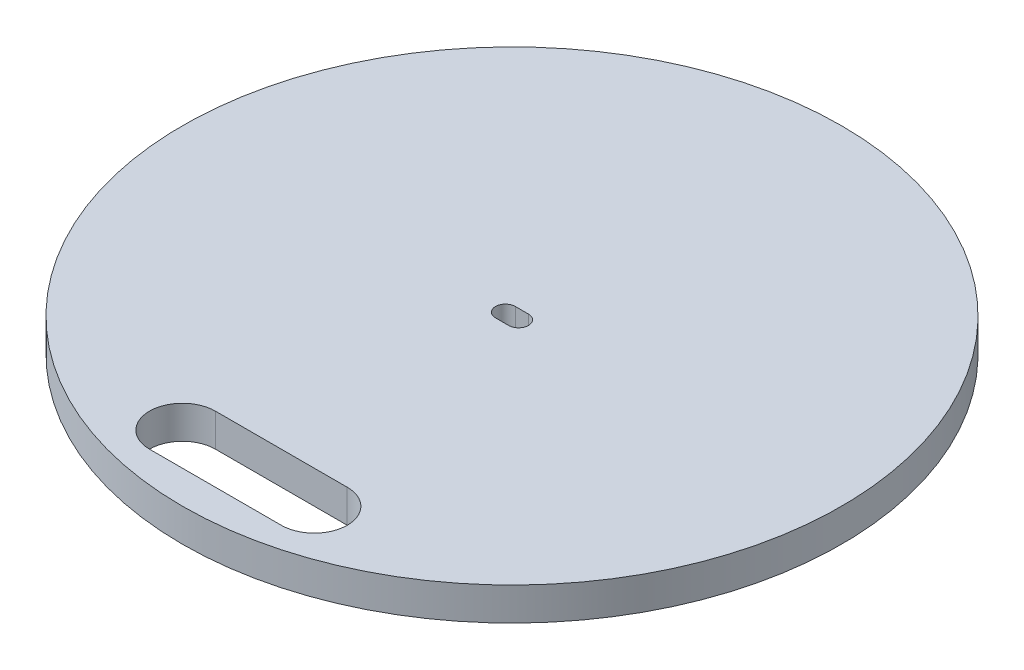
ISO-10303-21;
HEADER;
FILE_DESCRIPTION(('STEP AP214'),'2;1');
FILE_NAME('part.step','',(''),(''),'','','');
FILE_SCHEMA(('AUTOMOTIVE_DESIGN { 1 0 10303 214 1 1 1 1 }'));
ENDSEC;
DATA;
#1=APPLICATION_CONTEXT('core data for automotive mechanical design processes');
#2=APPLICATION_PROTOCOL_DEFINITION('international standard','automotive_design',2000,#1);
#3=PRODUCT_CONTEXT('',#1,'mechanical');
#4=PRODUCT('Part','Part','',(#3));
#5=PRODUCT_RELATED_PRODUCT_CATEGORY('part','',(#4));
#6=PRODUCT_DEFINITION_FORMATION('','',#4);
#7=PRODUCT_DEFINITION_CONTEXT('part definition',#1,'design');
#8=PRODUCT_DEFINITION('design','',#6,#7);
#9=PRODUCT_DEFINITION_SHAPE('','',#8);
#10=(LENGTH_UNIT() NAMED_UNIT(*) SI_UNIT(.MILLI.,.METRE.));
#11=(NAMED_UNIT(*) PLANE_ANGLE_UNIT() SI_UNIT($,.RADIAN.));
#12=(NAMED_UNIT(*) SI_UNIT($,.STERADIAN.) SOLID_ANGLE_UNIT());
#13=UNCERTAINTY_MEASURE_WITH_UNIT(LENGTH_MEASURE(1.E-05),#10,'distance_accuracy_value','');
#14=(GEOMETRIC_REPRESENTATION_CONTEXT(3) GLOBAL_UNCERTAINTY_ASSIGNED_CONTEXT((#13)) GLOBAL_UNIT_ASSIGNED_CONTEXT((#10,
#11,#12)) REPRESENTATION_CONTEXT('',''));
#15=CARTESIAN_POINT('',(0.,0.,0.));
#16=DIRECTION('',(0.,0.,1.));
#17=DIRECTION('',(1.,0.,0.));
#18=AXIS2_PLACEMENT_3D('',#15,#16,#17);
#19=CARTESIAN_POINT('',(0.,5.,0.));
#20=DIRECTION('',(0.,-1.,0.));
#21=DIRECTION('',(0.,0.,-1.));
#22=AXIS2_PLACEMENT_3D('',#19,#20,#21);
#23=CYLINDRICAL_SURFACE('',#22,50.);
#24=CARTESIAN_POINT('',(0.,5.,0.));
#25=DIRECTION('',(0.,1.,0.));
#26=DIRECTION('',(0.,0.,1.));
#27=AXIS2_PLACEMENT_3D('',#24,#25,#26);
#28=CIRCLE('',#27,50.);
#29=CARTESIAN_POINT('',(0.,5.,50.));
#30=VERTEX_POINT('',#29);
#31=EDGE_CURVE('E11',#30,#30,#28,.T.);
#32=ORIENTED_EDGE('',*,*,#31,.F.);
#33=EDGE_LOOP('',(#32));
#34=FACE_BOUND('',#33,.T.);
#35=CARTESIAN_POINT('',(0.,0.,0.));
#36=DIRECTION('',(0.,1.,0.));
#37=DIRECTION('',(0.,0.,1.));
#38=AXIS2_PLACEMENT_3D('',#35,#36,#37);
#39=CIRCLE('',#38,50.);
#40=CARTESIAN_POINT('',(0.,0.,50.));
#41=VERTEX_POINT('',#40);
#42=EDGE_CURVE('E36',#41,#41,#39,.T.);
#43=ORIENTED_EDGE('',*,*,#42,.T.);
#44=EDGE_LOOP('',(#43));
#45=FACE_BOUND('',#44,.T.);
#46=ADVANCED_FACE('F33',(#34,#45),#23,.T.);
#47=CARTESIAN_POINT('',(0.,5.,0.));
#48=DIRECTION('',(0.,1.,0.));
#49=DIRECTION('',(0.,0.,1.));
#50=AXIS2_PLACEMENT_3D('',#47,#48,#49);
#51=PLANE('',#50);
#52=CARTESIAN_POINT('',(-9.99999999999999,5.,40.));
#53=DIRECTION('',(0.,1.,0.));
#54=DIRECTION('',(0.,0.,1.));
#55=AXIS2_PLACEMENT_3D('',#52,#53,#54);
#56=CIRCLE('',#55,5.);
#57=CARTESIAN_POINT('',(-9.99999999999999,5.,35.));
#58=VERTEX_POINT('',#57);
#59=CARTESIAN_POINT('',(-9.99999999999999,5.,45.));
#60=VERTEX_POINT('',#59);
#61=EDGE_CURVE('E47',#58,#60,#56,.T.);
#62=ORIENTED_EDGE('',*,*,#61,.F.);
#63=DIRECTION('',(-1.,0.,0.));
#64=VECTOR('',#63,1.);
#65=CARTESIAN_POINT('',(-9.99999999999999,5.,35.));
#66=LINE('',#65,#64);
#67=CARTESIAN_POINT('',(10.,5.,35.));
#68=VERTEX_POINT('',#67);
#69=EDGE_CURVE('E115',#68,#58,#66,.T.);
#70=ORIENTED_EDGE('',*,*,#69,.F.);
#71=CARTESIAN_POINT('',(10.,5.,40.));
#72=DIRECTION('',(0.,1.,0.));
#73=DIRECTION('',(0.,0.,1.));
#74=AXIS2_PLACEMENT_3D('',#71,#72,#73);
#75=CIRCLE('',#74,5.);
#76=CARTESIAN_POINT('',(10.,5.,45.));
#77=VERTEX_POINT('',#76);
#78=EDGE_CURVE('E118',#77,#68,#75,.T.);
#79=ORIENTED_EDGE('',*,*,#78,.F.);
#80=DIRECTION('',(1.,0.,0.));
#81=VECTOR('',#80,1.);
#82=CARTESIAN_POINT('',(-9.99999999999999,5.,45.));
#83=LINE('',#82,#81);
#84=EDGE_CURVE('E124',#60,#77,#83,.T.);
#85=ORIENTED_EDGE('',*,*,#84,.F.);
#86=EDGE_LOOP('',(#62,#70,#79,#85));
#87=FACE_BOUND('',#86,.T.);
#88=CARTESIAN_POINT('',(-0.999999999999989,5.,0.));
#89=DIRECTION('',(0.,1.,0.));
#90=DIRECTION('',(0.,0.,1.));
#91=AXIS2_PLACEMENT_3D('',#88,#89,#90);
#92=CIRCLE('',#91,1.5);
#93=CARTESIAN_POINT('',(-0.999999999999989,5.,-1.5));
#94=VERTEX_POINT('',#93);
#95=CARTESIAN_POINT('',(-0.999999999999989,5.,1.5));
#96=VERTEX_POINT('',#95);
#97=EDGE_CURVE('E130',#94,#96,#92,.T.);
#98=ORIENTED_EDGE('',*,*,#97,.F.);
#99=DIRECTION('',(-1.,0.,0.));
#100=VECTOR('',#99,1.);
#101=CARTESIAN_POINT('',(-0.999999999999989,5.,-1.5));
#102=LINE('',#101,#100);
#103=CARTESIAN_POINT('',(0.999999999999989,5.,-1.5));
#104=VERTEX_POINT('',#103);
#105=EDGE_CURVE('E138',#104,#94,#102,.T.);
#106=ORIENTED_EDGE('',*,*,#105,.F.);
#107=CARTESIAN_POINT('',(0.999999999999992,5.,0.));
#108=DIRECTION('',(0.,1.,0.));
#109=DIRECTION('',(0.,0.,1.));
#110=AXIS2_PLACEMENT_3D('',#107,#108,#109);
#111=CIRCLE('',#110,1.5);
#112=CARTESIAN_POINT('',(0.999999999999988,5.,1.5));
#113=VERTEX_POINT('',#112);
#114=EDGE_CURVE('E152',#113,#104,#111,.T.);
#115=ORIENTED_EDGE('',*,*,#114,.F.);
#116=DIRECTION('',(1.,0.,0.));
#117=VECTOR('',#116,1.);
#118=CARTESIAN_POINT('',(-0.999999999999989,5.,1.5));
#119=LINE('',#118,#117);
#120=EDGE_CURVE('E149',#96,#113,#119,.T.);
#121=ORIENTED_EDGE('',*,*,#120,.F.);
#122=EDGE_LOOP('',(#98,#106,#115,#121));
#123=FACE_BOUND('',#122,.T.);
#124=ORIENTED_EDGE('',*,*,#31,.T.);
#125=EDGE_LOOP('',(#124));
#126=FACE_BOUND('',#125,.T.);
#127=ADVANCED_FACE('F174',(#87,#123,#126),#51,.T.);
#128=CARTESIAN_POINT('',(0.,0.,0.));
#129=DIRECTION('',(0.,1.,0.));
#130=DIRECTION('',(0.,0.,1.));
#131=AXIS2_PLACEMENT_3D('',#128,#129,#130);
#132=PLANE('',#131);
#133=DIRECTION('',(-1.,0.,0.));
#134=VECTOR('',#133,1.);
#135=CARTESIAN_POINT('',(-9.99999999999999,0.,35.));
#136=LINE('',#135,#134);
#137=CARTESIAN_POINT('',(10.,0.,35.));
#138=VERTEX_POINT('',#137);
#139=CARTESIAN_POINT('',(-9.99999999999999,0.,35.));
#140=VERTEX_POINT('',#139);
#141=EDGE_CURVE('E105',#138,#140,#136,.T.);
#142=ORIENTED_EDGE('',*,*,#141,.T.);
#143=CARTESIAN_POINT('',(-9.99999999999999,0.,40.));
#144=DIRECTION('',(0.,1.,0.));
#145=DIRECTION('',(0.,0.,1.));
#146=AXIS2_PLACEMENT_3D('',#143,#144,#145);
#147=CIRCLE('',#146,5.);
#148=CARTESIAN_POINT('',(-9.99999999999999,0.,45.));
#149=VERTEX_POINT('',#148);
#150=EDGE_CURVE('E99',#140,#149,#147,.T.);
#151=ORIENTED_EDGE('',*,*,#150,.T.);
#152=DIRECTION('',(1.,0.,0.));
#153=VECTOR('',#152,1.);
#154=CARTESIAN_POINT('',(-9.99999999999999,0.,45.));
#155=LINE('',#154,#153);
#156=CARTESIAN_POINT('',(10.,0.,45.));
#157=VERTEX_POINT('',#156);
#158=EDGE_CURVE('E108',#149,#157,#155,.T.);
#159=ORIENTED_EDGE('',*,*,#158,.T.);
#160=CARTESIAN_POINT('',(10.,0.,40.));
#161=DIRECTION('',(0.,1.,0.));
#162=DIRECTION('',(0.,0.,1.));
#163=AXIS2_PLACEMENT_3D('',#160,#161,#162);
#164=CIRCLE('',#163,5.);
#165=EDGE_CURVE('E55',#157,#138,#164,.T.);
#166=ORIENTED_EDGE('',*,*,#165,.T.);
#167=EDGE_LOOP('',(#142,#151,#159,#166));
#168=FACE_BOUND('',#167,.T.);
#169=DIRECTION('',(-1.,0.,0.));
#170=VECTOR('',#169,1.);
#171=CARTESIAN_POINT('',(-0.999999999999989,0.,-1.5));
#172=LINE('',#171,#170);
#173=CARTESIAN_POINT('',(0.999999999999989,0.,-1.5));
#174=VERTEX_POINT('',#173);
#175=CARTESIAN_POINT('',(-0.999999999999989,0.,-1.5));
#176=VERTEX_POINT('',#175);
#177=EDGE_CURVE('E144',#174,#176,#172,.T.);
#178=ORIENTED_EDGE('',*,*,#177,.T.);
#179=CARTESIAN_POINT('',(-0.999999999999989,0.,0.));
#180=DIRECTION('',(0.,1.,0.));
#181=DIRECTION('',(0.,0.,1.));
#182=AXIS2_PLACEMENT_3D('',#179,#180,#181);
#183=CIRCLE('',#182,1.5);
#184=CARTESIAN_POINT('',(-0.999999999999989,0.,1.5));
#185=VERTEX_POINT('',#184);
#186=EDGE_CURVE('E134',#176,#185,#183,.T.);
#187=ORIENTED_EDGE('',*,*,#186,.T.);
#188=DIRECTION('',(1.,0.,0.));
#189=VECTOR('',#188,1.);
#190=CARTESIAN_POINT('',(-0.999999999999989,0.,1.5));
#191=LINE('',#190,#189);
#192=CARTESIAN_POINT('',(0.999999999999988,0.,1.5));
#193=VERTEX_POINT('',#192);
#194=EDGE_CURVE('E137',#185,#193,#191,.T.);
#195=ORIENTED_EDGE('',*,*,#194,.T.);
#196=CARTESIAN_POINT('',(0.999999999999992,0.,0.));
#197=DIRECTION('',(0.,1.,0.));
#198=DIRECTION('',(0.,0.,1.));
#199=AXIS2_PLACEMENT_3D('',#196,#197,#198);
#200=CIRCLE('',#199,1.5);
#201=EDGE_CURVE('E141',#193,#174,#200,.T.);
#202=ORIENTED_EDGE('',*,*,#201,.T.);
#203=EDGE_LOOP('',(#178,#187,#195,#202));
#204=FACE_BOUND('',#203,.T.);
#205=ORIENTED_EDGE('',*,*,#42,.F.);
#206=EDGE_LOOP('',(#205));
#207=FACE_BOUND('',#206,.T.);
#208=ADVANCED_FACE('F112',(#168,#204,#207),#132,.F.);
#209=CARTESIAN_POINT('',(-0.999999999999989,0.,0.));
#210=DIRECTION('',(0.,1.,0.));
#211=DIRECTION('',(0.,0.,1.));
#212=AXIS2_PLACEMENT_3D('',#209,#210,#211);
#213=CYLINDRICAL_SURFACE('',#212,1.5);
#214=ORIENTED_EDGE('',*,*,#97,.T.);
#215=DIRECTION('',(0.,1.,0.));
#216=VECTOR('',#215,1.);
#217=CARTESIAN_POINT('',(-0.999999999999989,0.,1.5));
#218=LINE('',#217,#216);
#219=EDGE_CURVE('E147',#185,#96,#218,.T.);
#220=ORIENTED_EDGE('',*,*,#219,.F.);
#221=ORIENTED_EDGE('',*,*,#186,.F.);
#222=DIRECTION('',(0.,1.,0.));
#223=VECTOR('',#222,1.);
#224=CARTESIAN_POINT('',(-0.999999999999989,0.,-1.5));
#225=LINE('',#224,#223);
#226=EDGE_CURVE('E157',#176,#94,#225,.T.);
#227=ORIENTED_EDGE('',*,*,#226,.T.);
#228=EDGE_LOOP('',(#214,#220,#221,#227));
#229=FACE_BOUND('',#228,.T.);
#230=ADVANCED_FACE('F181',(#229),#213,.F.);
#231=CARTESIAN_POINT('',(-0.999999999999989,0.,-1.5));
#232=DIRECTION('',(0.,0.,-1.));
#233=DIRECTION('',(-1.,0.,0.));
#234=AXIS2_PLACEMENT_3D('',#231,#232,#233);
#235=PLANE('',#234);
#236=ORIENTED_EDGE('',*,*,#105,.T.);
#237=ORIENTED_EDGE('',*,*,#226,.F.);
#238=ORIENTED_EDGE('',*,*,#177,.F.);
#239=DIRECTION('',(0.,1.,0.));
#240=VECTOR('',#239,1.);
#241=CARTESIAN_POINT('',(0.999999999999989,0.,-1.5));
#242=LINE('',#241,#240);
#243=EDGE_CURVE('E159',#174,#104,#242,.T.);
#244=ORIENTED_EDGE('',*,*,#243,.T.);
#245=EDGE_LOOP('',(#236,#237,#238,#244));
#246=FACE_BOUND('',#245,.T.);
#247=ADVANCED_FACE('F183',(#246),#235,.F.);
#248=CARTESIAN_POINT('',(0.999999999999992,0.,0.));
#249=DIRECTION('',(0.,1.,0.));
#250=DIRECTION('',(0.,0.,1.));
#251=AXIS2_PLACEMENT_3D('',#248,#249,#250);
#252=CYLINDRICAL_SURFACE('',#251,1.5);
#253=ORIENTED_EDGE('',*,*,#114,.T.);
#254=ORIENTED_EDGE('',*,*,#243,.F.);
#255=ORIENTED_EDGE('',*,*,#201,.F.);
#256=DIRECTION('',(0.,1.,0.));
#257=VECTOR('',#256,1.);
#258=CARTESIAN_POINT('',(0.999999999999988,0.,1.5));
#259=LINE('',#258,#257);
#260=EDGE_CURVE('E161',#193,#113,#259,.T.);
#261=ORIENTED_EDGE('',*,*,#260,.T.);
#262=EDGE_LOOP('',(#253,#254,#255,#261));
#263=FACE_BOUND('',#262,.T.);
#264=ADVANCED_FACE('F178',(#263),#252,.F.);
#265=CARTESIAN_POINT('',(-0.999999999999989,0.,1.5));
#266=DIRECTION('',(0.,0.,1.));
#267=DIRECTION('',(1.,0.,0.));
#268=AXIS2_PLACEMENT_3D('',#265,#266,#267);
#269=PLANE('',#268);
#270=ORIENTED_EDGE('',*,*,#120,.T.);
#271=ORIENTED_EDGE('',*,*,#260,.F.);
#272=ORIENTED_EDGE('',*,*,#194,.F.);
#273=ORIENTED_EDGE('',*,*,#219,.T.);
#274=EDGE_LOOP('',(#270,#271,#272,#273));
#275=FACE_BOUND('',#274,.T.);
#276=ADVANCED_FACE('F167',(#275),#269,.F.);
#277=CARTESIAN_POINT('',(-9.99999999999999,0.,40.));
#278=DIRECTION('',(0.,1.,0.));
#279=DIRECTION('',(0.,0.,1.));
#280=AXIS2_PLACEMENT_3D('',#277,#278,#279);
#281=CYLINDRICAL_SURFACE('',#280,5.);
#282=ORIENTED_EDGE('',*,*,#61,.T.);
#283=DIRECTION('',(0.,1.,0.));
#284=VECTOR('',#283,1.);
#285=CARTESIAN_POINT('',(-9.99999999999999,0.,45.));
#286=LINE('',#285,#284);
#287=EDGE_CURVE('E95',#149,#60,#286,.T.);
#288=ORIENTED_EDGE('',*,*,#287,.F.);
#289=ORIENTED_EDGE('',*,*,#150,.F.);
#290=DIRECTION('',(0.,1.,0.));
#291=VECTOR('',#290,1.);
#292=CARTESIAN_POINT('',(-9.99999999999999,0.,35.));
#293=LINE('',#292,#291);
#294=EDGE_CURVE('E128',#140,#58,#293,.T.);
#295=ORIENTED_EDGE('',*,*,#294,.T.);
#296=EDGE_LOOP('',(#282,#288,#289,#295));
#297=FACE_BOUND('',#296,.T.);
#298=ADVANCED_FACE('F97',(#297),#281,.F.);
#299=CARTESIAN_POINT('',(-9.99999999999999,0.,35.));
#300=DIRECTION('',(0.,0.,-1.));
#301=DIRECTION('',(-1.,0.,0.));
#302=AXIS2_PLACEMENT_3D('',#299,#300,#301);
#303=PLANE('',#302);
#304=ORIENTED_EDGE('',*,*,#69,.T.);
#305=ORIENTED_EDGE('',*,*,#294,.F.);
#306=ORIENTED_EDGE('',*,*,#141,.F.);
#307=DIRECTION('',(0.,1.,0.));
#308=VECTOR('',#307,1.);
#309=CARTESIAN_POINT('',(10.,0.,35.));
#310=LINE('',#309,#308);
#311=EDGE_CURVE('E131',#138,#68,#310,.T.);
#312=ORIENTED_EDGE('',*,*,#311,.T.);
#313=EDGE_LOOP('',(#304,#305,#306,#312));
#314=FACE_BOUND('',#313,.T.);
#315=ADVANCED_FACE('F212',(#314),#303,.F.);
#316=CARTESIAN_POINT('',(10.,0.,40.));
#317=DIRECTION('',(0.,1.,0.));
#318=DIRECTION('',(0.,0.,1.));
#319=AXIS2_PLACEMENT_3D('',#316,#317,#318);
#320=CYLINDRICAL_SURFACE('',#319,5.);
#321=ORIENTED_EDGE('',*,*,#78,.T.);
#322=ORIENTED_EDGE('',*,*,#311,.F.);
#323=ORIENTED_EDGE('',*,*,#165,.F.);
#324=DIRECTION('',(0.,1.,0.));
#325=VECTOR('',#324,1.);
#326=CARTESIAN_POINT('',(10.,0.,45.));
#327=LINE('',#326,#325);
#328=EDGE_CURVE('E104',#157,#77,#327,.T.);
#329=ORIENTED_EDGE('',*,*,#328,.T.);
#330=EDGE_LOOP('',(#321,#322,#323,#329));
#331=FACE_BOUND('',#330,.T.);
#332=ADVANCED_FACE('F216',(#331),#320,.F.);
#333=CARTESIAN_POINT('',(-9.99999999999999,0.,45.));
#334=DIRECTION('',(0.,0.,1.));
#335=DIRECTION('',(1.,0.,0.));
#336=AXIS2_PLACEMENT_3D('',#333,#334,#335);
#337=PLANE('',#336);
#338=ORIENTED_EDGE('',*,*,#84,.T.);
#339=ORIENTED_EDGE('',*,*,#328,.F.);
#340=ORIENTED_EDGE('',*,*,#158,.F.);
#341=ORIENTED_EDGE('',*,*,#287,.T.);
#342=EDGE_LOOP('',(#338,#339,#340,#341));
#343=FACE_BOUND('',#342,.T.);
#344=ADVANCED_FACE('F109',(#343),#337,.F.);
#345=CLOSED_SHELL('',(#46,#127,#208,#230,#247,#264,#276,#298,#315,#332,#344));
#346=MANIFOLD_SOLID_BREP('B2',#345);
#347=ADVANCED_BREP_SHAPE_REPRESENTATION('',(#18,#346),#14);
#348=SHAPE_DEFINITION_REPRESENTATION(#9,#347);
ENDSEC;
END-ISO-10303-21;
